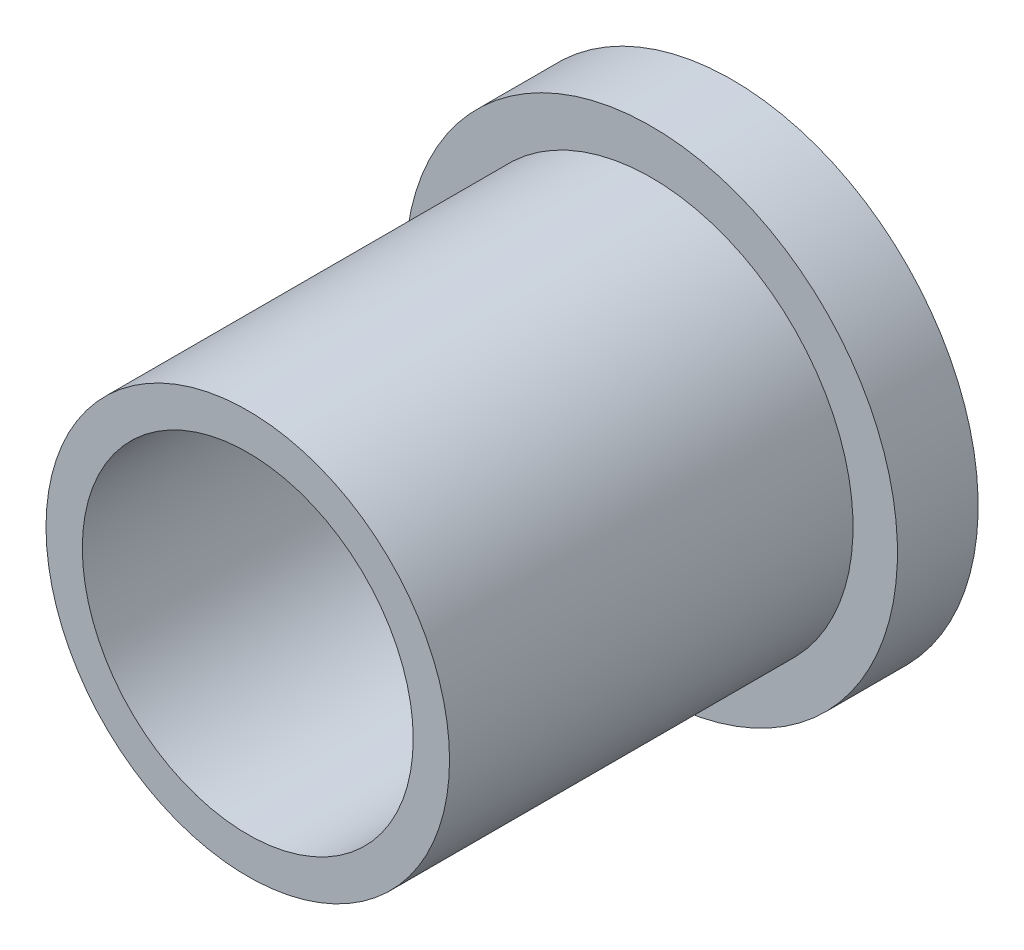
ISO-10303-21;
HEADER;
FILE_DESCRIPTION(('STEP AP214'),'2;1');
FILE_NAME('part.step','',(''),(''),'','','');
FILE_SCHEMA(('AUTOMOTIVE_DESIGN { 1 0 10303 214 1 1 1 1 }'));
ENDSEC;
DATA;
#1=APPLICATION_CONTEXT('core data for automotive mechanical design processes');
#2=APPLICATION_PROTOCOL_DEFINITION('international standard','automotive_design',2000,#1);
#3=PRODUCT_CONTEXT('',#1,'mechanical');
#4=PRODUCT('Part','Part','',(#3));
#5=PRODUCT_RELATED_PRODUCT_CATEGORY('part','',(#4));
#6=PRODUCT_DEFINITION_FORMATION('','',#4);
#7=PRODUCT_DEFINITION_CONTEXT('part definition',#1,'design');
#8=PRODUCT_DEFINITION('design','',#6,#7);
#9=PRODUCT_DEFINITION_SHAPE('','',#8);
#10=(LENGTH_UNIT() NAMED_UNIT(*) SI_UNIT(.MILLI.,.METRE.));
#11=(NAMED_UNIT(*) PLANE_ANGLE_UNIT() SI_UNIT($,.RADIAN.));
#12=(NAMED_UNIT(*) SI_UNIT($,.STERADIAN.) SOLID_ANGLE_UNIT());
#13=UNCERTAINTY_MEASURE_WITH_UNIT(LENGTH_MEASURE(1.E-05),#10,'distance_accuracy_value','');
#14=(GEOMETRIC_REPRESENTATION_CONTEXT(3) GLOBAL_UNCERTAINTY_ASSIGNED_CONTEXT((#13)) GLOBAL_UNIT_ASSIGNED_CONTEXT((#10,
#11,#12)) REPRESENTATION_CONTEXT('',''));
#15=CARTESIAN_POINT('',(0.,0.,0.));
#16=DIRECTION('',(0.,0.,1.));
#17=DIRECTION('',(1.,0.,0.));
#18=AXIS2_PLACEMENT_3D('',#15,#16,#17);
#19=CARTESIAN_POINT('',(0.,0.,10.));
#20=DIRECTION('',(0.,0.,1.));
#21=DIRECTION('',(1.,0.,0.));
#22=AXIS2_PLACEMENT_3D('',#19,#20,#21);
#23=PLANE('',#22);
#24=CARTESIAN_POINT('',(0.,0.,10.));
#25=DIRECTION('',(0.,0.,1.));
#26=DIRECTION('',(1.,0.,0.));
#27=AXIS2_PLACEMENT_3D('',#24,#25,#26);
#28=CIRCLE('',#27,5.);
#29=CARTESIAN_POINT('',(5.,0.,10.));
#30=VERTEX_POINT('',#29);
#31=EDGE_CURVE('E11',#30,#30,#28,.T.);
#32=ORIENTED_EDGE('',*,*,#31,.T.);
#33=EDGE_LOOP('',(#32));
#34=FACE_BOUND('',#33,.T.);
#35=CARTESIAN_POINT('',(0.,0.,10.));
#36=DIRECTION('',(0.,0.,1.));
#37=DIRECTION('',(1.,0.,0.));
#38=AXIS2_PLACEMENT_3D('',#35,#36,#37);
#39=CIRCLE('',#38,4.1);
#40=CARTESIAN_POINT('',(4.1,0.,10.));
#41=VERTEX_POINT('',#40);
#42=EDGE_CURVE('E43',#41,#41,#39,.T.);
#43=ORIENTED_EDGE('',*,*,#42,.F.);
#44=EDGE_LOOP('',(#43));
#45=FACE_BOUND('',#44,.T.);
#46=ADVANCED_FACE('F36',(#34,#45),#23,.T.);
#47=CARTESIAN_POINT('',(0.,0.,10.));
#48=DIRECTION('',(0.,0.,-1.));
#49=DIRECTION('',(-1.,0.,0.));
#50=AXIS2_PLACEMENT_3D('',#47,#48,#49);
#51=CYLINDRICAL_SURFACE('',#50,5.);
#52=ORIENTED_EDGE('',*,*,#31,.F.);
#53=EDGE_LOOP('',(#52));
#54=FACE_BOUND('',#53,.T.);
#55=CARTESIAN_POINT('',(0.,0.,0.));
#56=DIRECTION('',(0.,0.,-1.));
#57=DIRECTION('',(-1.,0.,0.));
#58=AXIS2_PLACEMENT_3D('',#55,#56,#57);
#59=CIRCLE('',#58,5.);
#60=CARTESIAN_POINT('',(-5.,0.,0.));
#61=VERTEX_POINT('',#60);
#62=EDGE_CURVE('E47',#61,#61,#59,.T.);
#63=ORIENTED_EDGE('',*,*,#62,.F.);
#64=EDGE_LOOP('',(#63));
#65=FACE_BOUND('',#64,.T.);
#66=ADVANCED_FACE('F38',(#54,#65),#51,.T.);
#67=CARTESIAN_POINT('',(0.,0.,10.));
#68=DIRECTION('',(0.,0.,-1.));
#69=DIRECTION('',(-1.,0.,0.));
#70=AXIS2_PLACEMENT_3D('',#67,#68,#69);
#71=CYLINDRICAL_SURFACE('',#70,4.1);
#72=ORIENTED_EDGE('',*,*,#42,.T.);
#73=EDGE_LOOP('',(#72));
#74=FACE_BOUND('',#73,.T.);
#75=CARTESIAN_POINT('',(0.,0.,-2.));
#76=DIRECTION('',(0.,0.,-1.));
#77=DIRECTION('',(-1.,0.,0.));
#78=AXIS2_PLACEMENT_3D('',#75,#76,#77);
#79=CIRCLE('',#78,4.1);
#80=CARTESIAN_POINT('',(-4.1,0.,-2.));
#81=VERTEX_POINT('',#80);
#82=EDGE_CURVE('E57',#81,#81,#79,.T.);
#83=ORIENTED_EDGE('',*,*,#82,.T.);
#84=EDGE_LOOP('',(#83));
#85=FACE_BOUND('',#84,.T.);
#86=ADVANCED_FACE('F63',(#74,#85),#71,.F.);
#87=CARTESIAN_POINT('',(0.,0.,0.));
#88=DIRECTION('',(0.,0.,-1.));
#89=DIRECTION('',(-1.,0.,0.));
#90=AXIS2_PLACEMENT_3D('',#87,#88,#89);
#91=PLANE('',#90);
#92=CARTESIAN_POINT('',(0.,0.,0.));
#93=DIRECTION('',(0.,0.,-1.));
#94=DIRECTION('',(-1.,0.,0.));
#95=AXIS2_PLACEMENT_3D('',#92,#93,#94);
#96=CIRCLE('',#95,6.1);
#97=CARTESIAN_POINT('',(-6.1,0.,0.));
#98=VERTEX_POINT('',#97);
#99=EDGE_CURVE('E54',#98,#98,#96,.T.);
#100=ORIENTED_EDGE('',*,*,#99,.F.);
#101=EDGE_LOOP('',(#100));
#102=FACE_BOUND('',#101,.T.);
#103=ORIENTED_EDGE('',*,*,#62,.T.);
#104=EDGE_LOOP('',(#103));
#105=FACE_BOUND('',#104,.T.);
#106=ADVANCED_FACE('F68',(#102,#105),#91,.F.);
#107=CARTESIAN_POINT('',(0.,0.,-2.));
#108=DIRECTION('',(0.,0.,-1.));
#109=DIRECTION('',(-1.,0.,0.));
#110=AXIS2_PLACEMENT_3D('',#107,#108,#109);
#111=PLANE('',#110);
#112=CARTESIAN_POINT('',(0.,0.,-2.));
#113=DIRECTION('',(0.,0.,-1.));
#114=DIRECTION('',(-1.,0.,0.));
#115=AXIS2_PLACEMENT_3D('',#112,#113,#114);
#116=CIRCLE('',#115,6.1);
#117=CARTESIAN_POINT('',(-6.1,0.,-2.));
#118=VERTEX_POINT('',#117);
#119=EDGE_CURVE('E51',#118,#118,#116,.T.);
#120=ORIENTED_EDGE('',*,*,#119,.T.);
#121=EDGE_LOOP('',(#120));
#122=FACE_BOUND('',#121,.T.);
#123=ORIENTED_EDGE('',*,*,#82,.F.);
#124=EDGE_LOOP('',(#123));
#125=FACE_BOUND('',#124,.T.);
#126=ADVANCED_FACE('F65',(#122,#125),#111,.T.);
#127=CARTESIAN_POINT('',(0.,0.,-2.));
#128=DIRECTION('',(0.,0.,1.));
#129=DIRECTION('',(1.,0.,0.));
#130=AXIS2_PLACEMENT_3D('',#127,#128,#129);
#131=CYLINDRICAL_SURFACE('',#130,6.1);
#132=ORIENTED_EDGE('',*,*,#119,.F.);
#133=EDGE_LOOP('',(#132));
#134=FACE_BOUND('',#133,.T.);
#135=ORIENTED_EDGE('',*,*,#99,.T.);
#136=EDGE_LOOP('',(#135));
#137=FACE_BOUND('',#136,.T.);
#138=ADVANCED_FACE('F67',(#134,#137),#131,.T.);
#139=CLOSED_SHELL('',(#46,#66,#86,#106,#126,#138));
#140=MANIFOLD_SOLID_BREP('B2',#139);
#141=ADVANCED_BREP_SHAPE_REPRESENTATION('',(#18,#140),#14);
#142=SHAPE_DEFINITION_REPRESENTATION(#9,#141);
ENDSEC;
END-ISO-10303-21;
